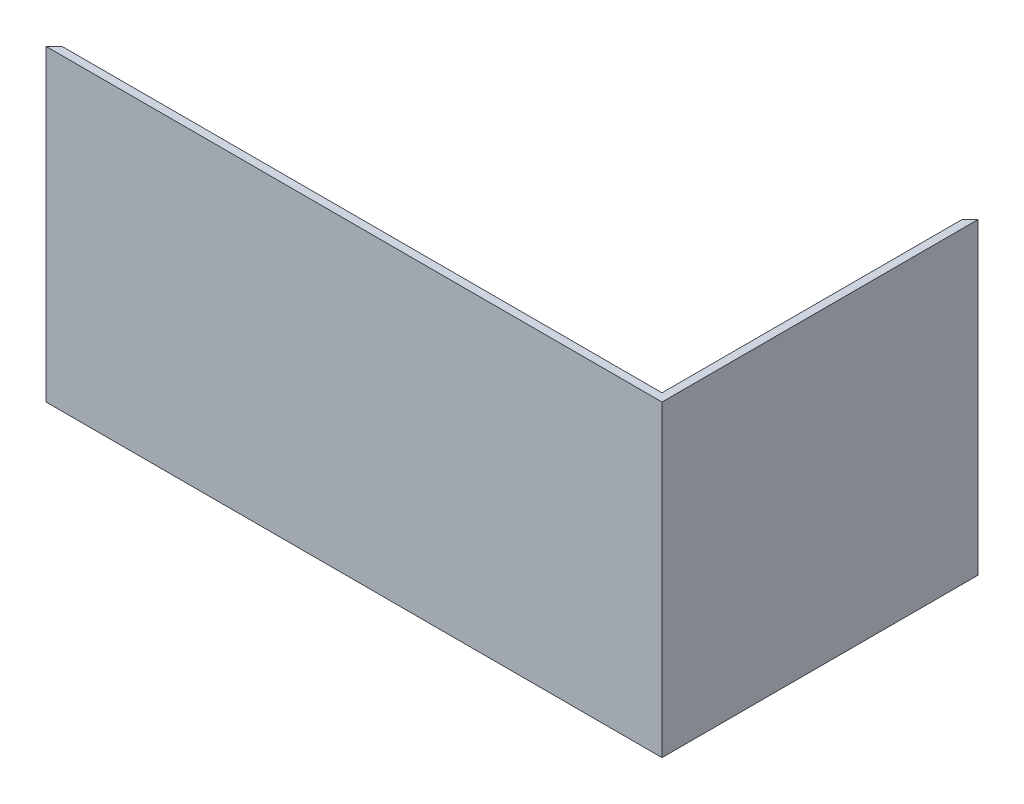
ISO-10303-21;
HEADER;
FILE_DESCRIPTION(('STEP AP214'),'2;1');
FILE_NAME('part.step','',(''),(''),'','','');
FILE_SCHEMA(('AUTOMOTIVE_DESIGN { 1 0 10303 214 1 1 1 1 }'));
ENDSEC;
DATA;
#1=APPLICATION_CONTEXT('core data for automotive mechanical design processes');
#2=APPLICATION_PROTOCOL_DEFINITION('international standard','automotive_design',2000,#1);
#3=PRODUCT_CONTEXT('',#1,'mechanical');
#4=PRODUCT('Part','Part','',(#3));
#5=PRODUCT_RELATED_PRODUCT_CATEGORY('part','',(#4));
#6=PRODUCT_DEFINITION_FORMATION('','',#4);
#7=PRODUCT_DEFINITION_CONTEXT('part definition',#1,'design');
#8=PRODUCT_DEFINITION('design','',#6,#7);
#9=PRODUCT_DEFINITION_SHAPE('','',#8);
#10=(LENGTH_UNIT() NAMED_UNIT(*) SI_UNIT(.MILLI.,.METRE.));
#11=(NAMED_UNIT(*) PLANE_ANGLE_UNIT() SI_UNIT($,.RADIAN.));
#12=(NAMED_UNIT(*) SI_UNIT($,.STERADIAN.) SOLID_ANGLE_UNIT());
#13=UNCERTAINTY_MEASURE_WITH_UNIT(LENGTH_MEASURE(1.E-05),#10,'distance_accuracy_value','');
#14=(GEOMETRIC_REPRESENTATION_CONTEXT(3) GLOBAL_UNCERTAINTY_ASSIGNED_CONTEXT((#13)) GLOBAL_UNIT_ASSIGNED_CONTEXT((#10,
#11,#12)) REPRESENTATION_CONTEXT('',''));
#15=CARTESIAN_POINT('',(0.,0.,0.));
#16=DIRECTION('',(0.,0.,1.));
#17=DIRECTION('',(1.,0.,0.));
#18=AXIS2_PLACEMENT_3D('',#15,#16,#17);
#19=CARTESIAN_POINT('',(0.,308.,150.));
#20=DIRECTION('',(0.,0.,1.));
#21=DIRECTION('',(-1.,0.,0.));
#22=AXIS2_PLACEMENT_3D('',#19,#20,#21);
#23=PLANE('',#22);
#24=DIRECTION('',(0.,-1.,0.));
#25=VECTOR('',#24,1.);
#26=CARTESIAN_POINT('',(-300.,308.,150.));
#27=LINE('',#26,#25);
#28=CARTESIAN_POINT('',(-300.,308.,150.));
#29=VERTEX_POINT('',#28);
#30=CARTESIAN_POINT('',(-300.,8.00000000000001,150.));
#31=VERTEX_POINT('',#30);
#32=EDGE_CURVE('E148',#29,#31,#27,.T.);
#33=ORIENTED_EDGE('',*,*,#32,.F.);
#34=DIRECTION('',(1.,0.,0.));
#35=VECTOR('',#34,1.);
#36=CARTESIAN_POINT('',(0.,308.,150.));
#37=LINE('',#36,#35);
#38=CARTESIAN_POINT('',(300.,308.,150.));
#39=VERTEX_POINT('',#38);
#40=EDGE_CURVE('E132',#29,#39,#37,.T.);
#41=ORIENTED_EDGE('',*,*,#40,.T.);
#42=DIRECTION('',(0.,-1.,0.));
#43=VECTOR('',#42,1.);
#44=CARTESIAN_POINT('',(300.,308.,150.));
#45=LINE('',#44,#43);
#46=CARTESIAN_POINT('',(300.,8.00000000000001,150.));
#47=VERTEX_POINT('',#46);
#48=EDGE_CURVE('E11',#39,#47,#45,.T.);
#49=ORIENTED_EDGE('',*,*,#48,.T.);
#50=DIRECTION('',(1.,0.,0.));
#51=VECTOR('',#50,1.);
#52=CARTESIAN_POINT('',(0.,8.,150.));
#53=LINE('',#52,#51);
#54=EDGE_CURVE('E121',#31,#47,#53,.T.);
#55=ORIENTED_EDGE('',*,*,#54,.F.);
#56=EDGE_LOOP('',(#33,#41,#49,#55));
#57=FACE_BOUND('',#56,.T.);
#58=ADVANCED_FACE('F39',(#57),#23,.F.);
#59=CARTESIAN_POINT('',(300.,308.,0.));
#60=DIRECTION('',(1.,0.,0.));
#61=DIRECTION('',(0.,0.,1.));
#62=AXIS2_PLACEMENT_3D('',#59,#60,#61);
#63=PLANE('',#62);
#64=ORIENTED_EDGE('',*,*,#48,.F.);
#65=DIRECTION('',(0.,0.,-1.));
#66=VECTOR('',#65,1.);
#67=CARTESIAN_POINT('',(300.,308.,0.));
#68=LINE('',#67,#66);
#69=CARTESIAN_POINT('',(300.,308.,-150.));
#70=VERTEX_POINT('',#69);
#71=EDGE_CURVE('E135',#39,#70,#68,.T.);
#72=ORIENTED_EDGE('',*,*,#71,.T.);
#73=DIRECTION('',(0.,-1.,0.));
#74=VECTOR('',#73,1.);
#75=CARTESIAN_POINT('',(300.,308.,-150.));
#76=LINE('',#75,#74);
#77=CARTESIAN_POINT('',(300.,8.00000000000001,-150.));
#78=VERTEX_POINT('',#77);
#79=EDGE_CURVE('E46',#70,#78,#76,.T.);
#80=ORIENTED_EDGE('',*,*,#79,.T.);
#81=DIRECTION('',(0.,0.,-1.));
#82=VECTOR('',#81,1.);
#83=CARTESIAN_POINT('',(300.,8.,0.));
#84=LINE('',#83,#82);
#85=EDGE_CURVE('E53',#47,#78,#84,.T.);
#86=ORIENTED_EDGE('',*,*,#85,.F.);
#87=EDGE_LOOP('',(#64,#72,#80,#86));
#88=FACE_BOUND('',#87,.T.);
#89=ADVANCED_FACE('F167',(#88),#63,.F.);
#90=CARTESIAN_POINT('',(74.9999999999995,308.,74.9999999999998));
#91=DIRECTION('',(0.707106781186546,0.,0.707106781186549));
#92=DIRECTION('',(-0.707106781186549,0.,0.707106781186546));
#93=AXIS2_PLACEMENT_3D('',#90,#91,#92);
#94=PLANE('',#93);
#95=DIRECTION('',(0.707106781186549,0.,-0.707106781186546));
#96=VECTOR('',#95,1.);
#97=CARTESIAN_POINT('',(74.9999999999995,0.,74.9999999999998));
#98=LINE('',#97,#96);
#99=CARTESIAN_POINT('',(300.,0.,-150.));
#100=VERTEX_POINT('',#99);
#101=CARTESIAN_POINT('',(308.,0.,-158.));
#102=VERTEX_POINT('',#101);
#103=EDGE_CURVE('E131',#100,#102,#98,.T.);
#104=ORIENTED_EDGE('',*,*,#103,.F.);
#105=DIRECTION('',(0.,-1.,0.));
#106=VECTOR('',#105,1.);
#107=CARTESIAN_POINT('',(300.,8.,-150.));
#108=LINE('',#107,#106);
#109=EDGE_CURVE('E108',#78,#100,#108,.T.);
#110=ORIENTED_EDGE('',*,*,#109,.F.);
#111=ORIENTED_EDGE('',*,*,#79,.F.);
#112=DIRECTION('',(0.707106781186549,0.,-0.707106781186546));
#113=VECTOR('',#112,1.);
#114=CARTESIAN_POINT('',(74.9999999999995,308.,74.9999999999998));
#115=LINE('',#114,#113);
#116=CARTESIAN_POINT('',(308.,308.,-158.));
#117=VERTEX_POINT('',#116);
#118=EDGE_CURVE('E139',#70,#117,#115,.T.);
#119=ORIENTED_EDGE('',*,*,#118,.T.);
#120=DIRECTION('',(0.,-1.,0.));
#121=VECTOR('',#120,1.);
#122=CARTESIAN_POINT('',(308.,308.,-158.));
#123=LINE('',#122,#121);
#124=EDGE_CURVE('E164',#117,#102,#123,.T.);
#125=ORIENTED_EDGE('',*,*,#124,.T.);
#126=EDGE_LOOP('',(#104,#110,#111,#119,#125));
#127=FACE_BOUND('',#126,.T.);
#128=ADVANCED_FACE('F170',(#127),#94,.F.);
#129=CARTESIAN_POINT('',(308.,308.,0.));
#130=DIRECTION('',(1.,0.,0.));
#131=DIRECTION('',(0.,0.,1.));
#132=AXIS2_PLACEMENT_3D('',#129,#130,#131);
#133=PLANE('',#132);
#134=DIRECTION('',(0.,0.,-1.));
#135=VECTOR('',#134,1.);
#136=CARTESIAN_POINT('',(308.,0.,0.));
#137=LINE('',#136,#135);
#138=CARTESIAN_POINT('',(308.,0.,158.));
#139=VERTEX_POINT('',#138);
#140=EDGE_CURVE('E151',#139,#102,#137,.T.);
#141=ORIENTED_EDGE('',*,*,#140,.T.);
#142=ORIENTED_EDGE('',*,*,#124,.F.);
#143=DIRECTION('',(0.,0.,-1.));
#144=VECTOR('',#143,1.);
#145=CARTESIAN_POINT('',(308.,308.,0.));
#146=LINE('',#145,#144);
#147=CARTESIAN_POINT('',(308.,308.,158.));
#148=VERTEX_POINT('',#147);
#149=EDGE_CURVE('E142',#148,#117,#146,.T.);
#150=ORIENTED_EDGE('',*,*,#149,.F.);
#151=DIRECTION('',(0.,-1.,0.));
#152=VECTOR('',#151,1.);
#153=CARTESIAN_POINT('',(308.,308.,158.));
#154=LINE('',#153,#152);
#155=EDGE_CURVE('E161',#148,#139,#154,.T.);
#156=ORIENTED_EDGE('',*,*,#155,.T.);
#157=EDGE_LOOP('',(#141,#142,#150,#156));
#158=FACE_BOUND('',#157,.T.);
#159=ADVANCED_FACE('F189',(#158),#133,.T.);
#160=CARTESIAN_POINT('',(0.,308.,158.));
#161=DIRECTION('',(0.,0.,1.));
#162=DIRECTION('',(-1.,0.,0.));
#163=AXIS2_PLACEMENT_3D('',#160,#161,#162);
#164=PLANE('',#163);
#165=DIRECTION('',(1.,0.,0.));
#166=VECTOR('',#165,1.);
#167=CARTESIAN_POINT('',(0.,0.,158.));
#168=LINE('',#167,#166);
#169=CARTESIAN_POINT('',(-308.,0.,158.));
#170=VERTEX_POINT('',#169);
#171=EDGE_CURVE('E153',#170,#139,#168,.T.);
#172=ORIENTED_EDGE('',*,*,#171,.T.);
#173=ORIENTED_EDGE('',*,*,#155,.F.);
#174=DIRECTION('',(1.,0.,0.));
#175=VECTOR('',#174,1.);
#176=CARTESIAN_POINT('',(0.,308.,158.));
#177=LINE('',#176,#175);
#178=CARTESIAN_POINT('',(-308.,308.,158.));
#179=VERTEX_POINT('',#178);
#180=EDGE_CURVE('E144',#179,#148,#177,.T.);
#181=ORIENTED_EDGE('',*,*,#180,.F.);
#182=DIRECTION('',(0.,-1.,0.));
#183=VECTOR('',#182,1.);
#184=CARTESIAN_POINT('',(-308.,308.,158.));
#185=LINE('',#184,#183);
#186=EDGE_CURVE('E158',#179,#170,#185,.T.);
#187=ORIENTED_EDGE('',*,*,#186,.T.);
#188=EDGE_LOOP('',(#172,#173,#181,#187));
#189=FACE_BOUND('',#188,.T.);
#190=ADVANCED_FACE('F191',(#189),#164,.T.);
#191=CARTESIAN_POINT('',(-74.9999999999989,308.,-74.9999999999995));
#192=DIRECTION('',(-0.707106781186545,0.,-0.70710678118655));
#193=DIRECTION('',(0.70710678118655,0.,-0.707106781186545));
#194=AXIS2_PLACEMENT_3D('',#191,#192,#193);
#195=PLANE('',#194);
#196=DIRECTION('',(-0.70710678118655,0.,0.707106781186545));
#197=VECTOR('',#196,1.);
#198=CARTESIAN_POINT('',(-74.9999999999989,0.,-74.9999999999995));
#199=LINE('',#198,#197);
#200=CARTESIAN_POINT('',(-300.,0.,150.));
#201=VERTEX_POINT('',#200);
#202=EDGE_CURVE('E136',#201,#170,#199,.T.);
#203=ORIENTED_EDGE('',*,*,#202,.T.);
#204=ORIENTED_EDGE('',*,*,#186,.F.);
#205=DIRECTION('',(-0.70710678118655,0.,0.707106781186545));
#206=VECTOR('',#205,1.);
#207=CARTESIAN_POINT('',(-74.9999999999989,308.,-74.9999999999995));
#208=LINE('',#207,#206);
#209=EDGE_CURVE('E146',#29,#179,#208,.T.);
#210=ORIENTED_EDGE('',*,*,#209,.F.);
#211=ORIENTED_EDGE('',*,*,#32,.T.);
#212=DIRECTION('',(0.,-1.,0.));
#213=VECTOR('',#212,1.);
#214=CARTESIAN_POINT('',(-300.,8.,150.));
#215=LINE('',#214,#213);
#216=EDGE_CURVE('E116',#31,#201,#215,.T.);
#217=ORIENTED_EDGE('',*,*,#216,.T.);
#218=EDGE_LOOP('',(#203,#204,#210,#211,#217));
#219=FACE_BOUND('',#218,.T.);
#220=ADVANCED_FACE('F178',(#219),#195,.T.);
#221=CARTESIAN_POINT('',(0.,308.,0.));
#222=DIRECTION('',(0.,1.,0.));
#223=DIRECTION('',(0.,0.,-1.));
#224=AXIS2_PLACEMENT_3D('',#221,#222,#223);
#225=PLANE('',#224);
#226=ORIENTED_EDGE('',*,*,#40,.F.);
#227=ORIENTED_EDGE('',*,*,#209,.T.);
#228=ORIENTED_EDGE('',*,*,#180,.T.);
#229=ORIENTED_EDGE('',*,*,#149,.T.);
#230=ORIENTED_EDGE('',*,*,#118,.F.);
#231=ORIENTED_EDGE('',*,*,#71,.F.);
#232=EDGE_LOOP('',(#226,#227,#228,#229,#230,#231));
#233=FACE_BOUND('',#232,.T.);
#234=ADVANCED_FACE('F184',(#233),#225,.T.);
#235=CARTESIAN_POINT('',(0.,0.,0.));
#236=DIRECTION('',(0.,1.,0.));
#237=DIRECTION('',(0.,0.,-1.));
#238=AXIS2_PLACEMENT_3D('',#235,#236,#237);
#239=PLANE('',#238);
#240=ORIENTED_EDGE('',*,*,#103,.T.);
#241=ORIENTED_EDGE('',*,*,#140,.F.);
#242=ORIENTED_EDGE('',*,*,#171,.F.);
#243=ORIENTED_EDGE('',*,*,#202,.F.);
#244=DIRECTION('',(0.,0.,-1.));
#245=VECTOR('',#244,1.);
#246=CARTESIAN_POINT('',(-300.,0.,0.));
#247=LINE('',#246,#245);
#248=CARTESIAN_POINT('',(-300.,0.,-150.));
#249=VERTEX_POINT('',#248);
#250=EDGE_CURVE('E126',#201,#249,#247,.T.);
#251=ORIENTED_EDGE('',*,*,#250,.T.);
#252=DIRECTION('',(1.,0.,0.));
#253=VECTOR('',#252,1.);
#254=CARTESIAN_POINT('',(0.,0.,-150.));
#255=LINE('',#254,#253);
#256=EDGE_CURVE('E113',#249,#100,#255,.T.);
#257=ORIENTED_EDGE('',*,*,#256,.T.);
#258=EDGE_LOOP('',(#240,#241,#242,#243,#251,#257));
#259=FACE_BOUND('',#258,.T.);
#260=ADVANCED_FACE('F174',(#259),#239,.F.);
#261=CARTESIAN_POINT('',(-300.,8.,0.));
#262=DIRECTION('',(1.,0.,0.));
#263=DIRECTION('',(0.,0.,1.));
#264=AXIS2_PLACEMENT_3D('',#261,#262,#263);
#265=PLANE('',#264);
#266=ORIENTED_EDGE('',*,*,#250,.F.);
#267=ORIENTED_EDGE('',*,*,#216,.F.);
#268=DIRECTION('',(0.,0.,-1.));
#269=VECTOR('',#268,1.);
#270=CARTESIAN_POINT('',(-300.,8.,0.));
#271=LINE('',#270,#269);
#272=CARTESIAN_POINT('',(-300.,8.,-150.));
#273=VERTEX_POINT('',#272);
#274=EDGE_CURVE('E106',#31,#273,#271,.T.);
#275=ORIENTED_EDGE('',*,*,#274,.T.);
#276=DIRECTION('',(0.,-1.,0.));
#277=VECTOR('',#276,1.);
#278=CARTESIAN_POINT('',(-300.,8.,-150.));
#279=LINE('',#278,#277);
#280=EDGE_CURVE('E111',#273,#249,#279,.T.);
#281=ORIENTED_EDGE('',*,*,#280,.T.);
#282=EDGE_LOOP('',(#266,#267,#275,#281));
#283=FACE_BOUND('',#282,.T.);
#284=ADVANCED_FACE('F118',(#283),#265,.F.);
#285=CARTESIAN_POINT('',(0.,8.,-150.));
#286=DIRECTION('',(0.,0.,1.));
#287=DIRECTION('',(-1.,0.,0.));
#288=AXIS2_PLACEMENT_3D('',#285,#286,#287);
#289=PLANE('',#288);
#290=ORIENTED_EDGE('',*,*,#256,.F.);
#291=ORIENTED_EDGE('',*,*,#280,.F.);
#292=DIRECTION('',(1.,0.,0.));
#293=VECTOR('',#292,1.);
#294=CARTESIAN_POINT('',(0.,8.,-150.));
#295=LINE('',#294,#293);
#296=EDGE_CURVE('E61',#273,#78,#295,.T.);
#297=ORIENTED_EDGE('',*,*,#296,.T.);
#298=ORIENTED_EDGE('',*,*,#109,.T.);
#299=EDGE_LOOP('',(#290,#291,#297,#298));
#300=FACE_BOUND('',#299,.T.);
#301=ADVANCED_FACE('F112',(#300),#289,.F.);
#302=CARTESIAN_POINT('',(0.,8.,0.));
#303=DIRECTION('',(0.,1.,0.));
#304=DIRECTION('',(0.,0.,-1.));
#305=AXIS2_PLACEMENT_3D('',#302,#303,#304);
#306=PLANE('',#305);
#307=ORIENTED_EDGE('',*,*,#85,.T.);
#308=ORIENTED_EDGE('',*,*,#296,.F.);
#309=ORIENTED_EDGE('',*,*,#274,.F.);
#310=ORIENTED_EDGE('',*,*,#54,.T.);
#311=EDGE_LOOP('',(#307,#308,#309,#310));
#312=FACE_BOUND('',#311,.T.);
#313=ADVANCED_FACE('F104',(#312),#306,.T.);
#314=CLOSED_SHELL('',(#58,#89,#128,#159,#190,#220,#234,#260,#284,#301,#313));
#315=MANIFOLD_SOLID_BREP('B2',#314);
#316=ADVANCED_BREP_SHAPE_REPRESENTATION('',(#18,#315),#14);
#317=SHAPE_DEFINITION_REPRESENTATION(#9,#316);
ENDSEC;
END-ISO-10303-21;
